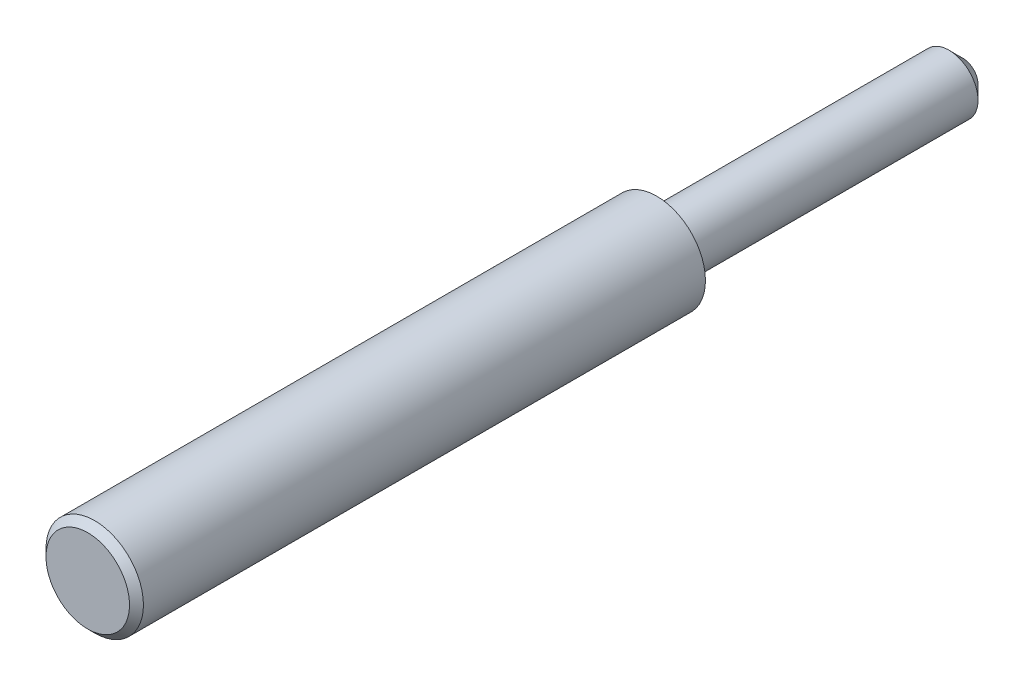
ISO-10303-21;
HEADER;
FILE_DESCRIPTION(('STEP AP214'),'2;1');
FILE_NAME('part.step','',(''),(''),'','','');
FILE_SCHEMA(('AUTOMOTIVE_DESIGN { 1 0 10303 214 1 1 1 1 }'));
ENDSEC;
DATA;
#1=APPLICATION_CONTEXT('core data for automotive mechanical design processes');
#2=APPLICATION_PROTOCOL_DEFINITION('international standard','automotive_design',2000,#1);
#3=PRODUCT_CONTEXT('',#1,'mechanical');
#4=PRODUCT('Part','Part','',(#3));
#5=PRODUCT_RELATED_PRODUCT_CATEGORY('part','',(#4));
#6=PRODUCT_DEFINITION_FORMATION('','',#4);
#7=PRODUCT_DEFINITION_CONTEXT('part definition',#1,'design');
#8=PRODUCT_DEFINITION('design','',#6,#7);
#9=PRODUCT_DEFINITION_SHAPE('','',#8);
#10=(LENGTH_UNIT() NAMED_UNIT(*) SI_UNIT(.MILLI.,.METRE.));
#11=(NAMED_UNIT(*) PLANE_ANGLE_UNIT() SI_UNIT($,.RADIAN.));
#12=(NAMED_UNIT(*) SI_UNIT($,.STERADIAN.) SOLID_ANGLE_UNIT());
#13=UNCERTAINTY_MEASURE_WITH_UNIT(LENGTH_MEASURE(1.E-05),#10,'distance_accuracy_value','');
#14=(GEOMETRIC_REPRESENTATION_CONTEXT(3) GLOBAL_UNCERTAINTY_ASSIGNED_CONTEXT((#13)) GLOBAL_UNIT_ASSIGNED_CONTEXT((#10,
#11,#12)) REPRESENTATION_CONTEXT('',''));
#15=CARTESIAN_POINT('',(0.,0.,0.));
#16=DIRECTION('',(0.,0.,1.));
#17=DIRECTION('',(1.,0.,0.));
#18=AXIS2_PLACEMENT_3D('',#15,#16,#17);
#19=CARTESIAN_POINT('',(0.,0.,-22.));
#20=DIRECTION('',(0.,0.,1.));
#21=DIRECTION('',(1.,0.,0.));
#22=AXIS2_PLACEMENT_3D('',#19,#20,#21);
#23=PLANE('',#22);
#24=CARTESIAN_POINT('',(0.,0.,-22.));
#25=DIRECTION('',(0.,0.,1.));
#26=DIRECTION('',(1.,0.,0.));
#27=AXIS2_PLACEMENT_3D('',#24,#25,#26);
#28=CIRCLE('',#27,1.08279999999999);
#29=CARTESIAN_POINT('',(1.08279999999999,0.,-22.));
#30=VERTEX_POINT('',#29);
#31=EDGE_CURVE('E43',#30,#30,#28,.F.);
#32=ORIENTED_EDGE('',*,*,#31,.T.);
#33=EDGE_LOOP('',(#32));
#34=FACE_BOUND('',#33,.T.);
#35=ADVANCED_FACE('F32',(#34),#23,.F.);
#36=CARTESIAN_POINT('',(0.,0.,0.));
#37=DIRECTION('',(0.,0.,1.));
#38=DIRECTION('',(1.,0.,0.));
#39=AXIS2_PLACEMENT_3D('',#36,#37,#38);
#40=CYLINDRICAL_SURFACE('',#39,2.0828);
#41=CARTESIAN_POINT('',(0.,0.,-21.));
#42=DIRECTION('',(0.,0.,1.));
#43=DIRECTION('',(1.,0.,0.));
#44=AXIS2_PLACEMENT_3D('',#41,#42,#43);
#45=CIRCLE('',#44,2.0828);
#46=CARTESIAN_POINT('',(2.0828,0.,-21.));
#47=VERTEX_POINT('',#46);
#48=EDGE_CURVE('E47',#47,#47,#45,.T.);
#49=ORIENTED_EDGE('',*,*,#48,.T.);
#50=EDGE_LOOP('',(#49));
#51=FACE_BOUND('',#50,.T.);
#52=CARTESIAN_POINT('',(0.,0.,0.));
#53=DIRECTION('',(0.,0.,1.));
#54=DIRECTION('',(1.,0.,0.));
#55=AXIS2_PLACEMENT_3D('',#52,#53,#54);
#56=CIRCLE('',#55,2.0828);
#57=CARTESIAN_POINT('',(2.0828,0.,0.));
#58=VERTEX_POINT('',#57);
#59=EDGE_CURVE('E52',#58,#58,#56,.T.);
#60=ORIENTED_EDGE('',*,*,#59,.F.);
#61=EDGE_LOOP('',(#60));
#62=FACE_BOUND('',#61,.T.);
#63=ADVANCED_FACE('F64',(#51,#62),#40,.T.);
#64=CARTESIAN_POINT('',(0.,2.0828,0.));
#65=DIRECTION('',(0.,0.,1.));
#66=DIRECTION('',(1.,0.,0.));
#67=AXIS2_PLACEMENT_3D('',#64,#65,#66);
#68=PLANE('',#67);
#69=CARTESIAN_POINT('',(0.,0.,0.));
#70=DIRECTION('',(0.,0.,1.));
#71=DIRECTION('',(1.,0.,0.));
#72=AXIS2_PLACEMENT_3D('',#69,#70,#71);
#73=CIRCLE('',#72,3.5);
#74=CARTESIAN_POINT('',(3.5,0.,0.));
#75=VERTEX_POINT('',#74);
#76=EDGE_CURVE('E55',#75,#75,#73,.T.);
#77=ORIENTED_EDGE('',*,*,#76,.F.);
#78=EDGE_LOOP('',(#77));
#79=FACE_BOUND('',#78,.T.);
#80=ORIENTED_EDGE('',*,*,#59,.T.);
#81=EDGE_LOOP('',(#80));
#82=FACE_BOUND('',#81,.T.);
#83=ADVANCED_FACE('F61',(#79,#82),#68,.F.);
#84=CARTESIAN_POINT('',(0.,0.,0.));
#85=DIRECTION('',(0.,0.,1.));
#86=DIRECTION('',(1.,0.,0.));
#87=AXIS2_PLACEMENT_3D('',#84,#85,#86);
#88=CYLINDRICAL_SURFACE('',#87,3.5);
#89=CARTESIAN_POINT('',(0.,0.,40.379));
#90=DIRECTION('',(0.,0.,-1.));
#91=DIRECTION('',(-1.,0.,0.));
#92=AXIS2_PLACEMENT_3D('',#89,#90,#91);
#93=CIRCLE('',#92,3.5);
#94=CARTESIAN_POINT('',(-3.5,0.,40.379));
#95=VERTEX_POINT('',#94);
#96=EDGE_CURVE('E10',#95,#95,#93,.T.);
#97=ORIENTED_EDGE('',*,*,#96,.T.);
#98=EDGE_LOOP('',(#97));
#99=FACE_BOUND('',#98,.T.);
#100=ORIENTED_EDGE('',*,*,#76,.T.);
#101=EDGE_LOOP('',(#100));
#102=FACE_BOUND('',#101,.T.);
#103=ADVANCED_FACE('F59',(#99,#102),#88,.T.);
#104=CARTESIAN_POINT('',(0.,3.49999999999999,40.879));
#105=DIRECTION('',(0.,0.,-1.));
#106=DIRECTION('',(-1.,0.,0.));
#107=AXIS2_PLACEMENT_3D('',#104,#105,#106);
#108=PLANE('',#107);
#109=CARTESIAN_POINT('',(0.,0.,40.879));
#110=DIRECTION('',(0.,0.,-1.));
#111=DIRECTION('',(-1.,0.,0.));
#112=AXIS2_PLACEMENT_3D('',#109,#110,#111);
#113=CIRCLE('',#112,3.);
#114=CARTESIAN_POINT('',(-3.,0.,40.879));
#115=VERTEX_POINT('',#114);
#116=EDGE_CURVE('E39',#115,#115,#113,.F.);
#117=ORIENTED_EDGE('',*,*,#116,.T.);
#118=EDGE_LOOP('',(#117));
#119=FACE_BOUND('',#118,.T.);
#120=ADVANCED_FACE('F79',(#119),#108,.F.);
#121=CARTESIAN_POINT('',(0.,0.,-21.));
#122=DIRECTION('',(0.,0.,1.));
#123=DIRECTION('',(1.,0.,0.));
#124=AXIS2_PLACEMENT_3D('',#121,#122,#123);
#125=CONICAL_SURFACE('',#124,2.0828,0.785398163397448);
#126=ORIENTED_EDGE('',*,*,#31,.F.);
#127=EDGE_LOOP('',(#126));
#128=FACE_BOUND('',#127,.T.);
#129=ORIENTED_EDGE('',*,*,#48,.F.);
#130=EDGE_LOOP('',(#129));
#131=FACE_BOUND('',#130,.T.);
#132=ADVANCED_FACE('F77',(#128,#131),#125,.T.);
#133=CARTESIAN_POINT('',(0.,0.,40.879));
#134=DIRECTION('',(0.,0.,-1.));
#135=DIRECTION('',(-1.,0.,0.));
#136=AXIS2_PLACEMENT_3D('',#133,#134,#135);
#137=CONICAL_SURFACE('',#136,3.,0.785398163397443);
#138=ORIENTED_EDGE('',*,*,#96,.F.);
#139=EDGE_LOOP('',(#138));
#140=FACE_BOUND('',#139,.T.);
#141=ORIENTED_EDGE('',*,*,#116,.F.);
#142=EDGE_LOOP('',(#141));
#143=FACE_BOUND('',#142,.T.);
#144=ADVANCED_FACE('F34',(#140,#143),#137,.T.);
#145=CLOSED_SHELL('',(#35,#63,#83,#103,#120,#132,#144));
#146=MANIFOLD_SOLID_BREP('B2',#145);
#147=ADVANCED_BREP_SHAPE_REPRESENTATION('',(#18,#146),#14);
#148=SHAPE_DEFINITION_REPRESENTATION(#9,#147);
ENDSEC;
END-ISO-10303-21;
